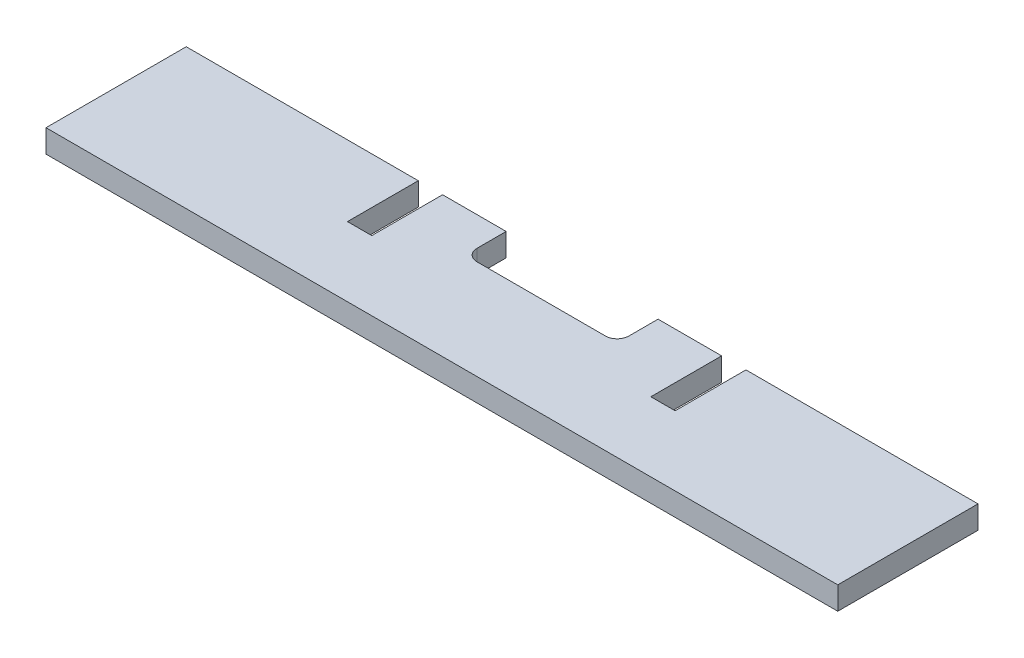
ISO-10303-21;
HEADER;
FILE_DESCRIPTION(('STEP AP214'),'2;1');
FILE_NAME('part.step','',(''),(''),'','','');
FILE_SCHEMA(('AUTOMOTIVE_DESIGN { 1 0 10303 214 1 1 1 1 }'));
ENDSEC;
DATA;
#1=APPLICATION_CONTEXT('core data for automotive mechanical design processes');
#2=APPLICATION_PROTOCOL_DEFINITION('international standard','automotive_design',2000,#1);
#3=PRODUCT_CONTEXT('',#1,'mechanical');
#4=PRODUCT('Part','Part','',(#3));
#5=PRODUCT_RELATED_PRODUCT_CATEGORY('part','',(#4));
#6=PRODUCT_DEFINITION_FORMATION('','',#4);
#7=PRODUCT_DEFINITION_CONTEXT('part definition',#1,'design');
#8=PRODUCT_DEFINITION('design','',#6,#7);
#9=PRODUCT_DEFINITION_SHAPE('','',#8);
#10=(LENGTH_UNIT() NAMED_UNIT(*) SI_UNIT(.MILLI.,.METRE.));
#11=(NAMED_UNIT(*) PLANE_ANGLE_UNIT() SI_UNIT($,.RADIAN.));
#12=(NAMED_UNIT(*) SI_UNIT($,.STERADIAN.) SOLID_ANGLE_UNIT());
#13=UNCERTAINTY_MEASURE_WITH_UNIT(LENGTH_MEASURE(1.E-05),#10,'distance_accuracy_value','');
#14=(GEOMETRIC_REPRESENTATION_CONTEXT(3) GLOBAL_UNCERTAINTY_ASSIGNED_CONTEXT((#13)) GLOBAL_UNIT_ASSIGNED_CONTEXT((#10,
#11,#12)) REPRESENTATION_CONTEXT('',''));
#15=CARTESIAN_POINT('',(0.,0.,0.));
#16=DIRECTION('',(0.,0.,1.));
#17=DIRECTION('',(1.,0.,0.));
#18=AXIS2_PLACEMENT_3D('',#15,#16,#17);
#19=CARTESIAN_POINT('',(4423.78804568099,847.725,0.));
#20=DIRECTION('',(0.,0.,1.));
#21=DIRECTION('',(1.,0.,0.));
#22=AXIS2_PLACEMENT_3D('',#19,#20,#21);
#23=PLANE('',#22);
#24=DIRECTION('',(0.,1.,0.));
#25=VECTOR('',#24,1.);
#26=CARTESIAN_POINT('',(-41.275,-2295.26058781173,0.));
#27=LINE('',#26,#25);
#28=CARTESIAN_POINT('',(-41.275,841.502,0.));
#29=VERTEX_POINT('',#28);
#30=CARTESIAN_POINT('',(-41.275,853.948,0.));
#31=VERTEX_POINT('',#30);
#32=EDGE_CURVE('E185',#29,#31,#27,.T.);
#33=ORIENTED_EDGE('',*,*,#32,.F.);
#34=DIRECTION('',(-1.,0.,0.));
#35=VECTOR('',#34,1.);
#36=CARTESIAN_POINT('',(4423.78804568099,841.502,0.));
#37=LINE('',#36,#35);
#38=CARTESIAN_POINT('',(-75.819,841.502,0.));
#39=VERTEX_POINT('',#38);
#40=EDGE_CURVE('E197',#29,#39,#37,.T.);
#41=ORIENTED_EDGE('',*,*,#40,.T.);
#42=DIRECTION('',(0.,-1.,0.));
#43=VECTOR('',#42,1.);
#44=CARTESIAN_POINT('',(-75.819,847.725,0.));
#45=LINE('',#44,#43);
#46=CARTESIAN_POINT('',(-75.819,853.948,0.));
#47=VERTEX_POINT('',#46);
#48=EDGE_CURVE('E341',#47,#39,#45,.T.);
#49=ORIENTED_EDGE('',*,*,#48,.F.);
#50=DIRECTION('',(-1.,0.,0.));
#51=VECTOR('',#50,1.);
#52=CARTESIAN_POINT('',(4423.78804568099,853.948,0.));
#53=LINE('',#52,#51);
#54=EDGE_CURVE('E199',#31,#47,#53,.T.);
#55=ORIENTED_EDGE('',*,*,#54,.F.);
#56=EDGE_LOOP('',(#33,#41,#49,#55));
#57=FACE_BOUND('',#56,.T.);
#58=ADVANCED_FACE('F14',(#57),#23,.F.);
#59=CARTESIAN_POINT('',(4423.78804568099,853.948,38.1));
#60=DIRECTION('',(0.,-1.,0.));
#61=DIRECTION('',(0.,0.,-1.));
#62=AXIS2_PLACEMENT_3D('',#59,#60,#61);
#63=PLANE('',#62);
#64=DIRECTION('',(0.,0.,-1.));
#65=VECTOR('',#64,1.);
#66=CARTESIAN_POINT('',(41.275,853.948,38.0999999999987));
#67=LINE('',#66,#65);
#68=CARTESIAN_POINT('',(41.275,853.948,15.875));
#69=VERTEX_POINT('',#68);
#70=CARTESIAN_POINT('',(41.275,853.948,0.));
#71=VERTEX_POINT('',#70);
#72=EDGE_CURVE('E311',#69,#71,#67,.T.);
#73=ORIENTED_EDGE('',*,*,#72,.F.);
#74=CARTESIAN_POINT('',(34.925,853.948,15.875));
#75=DIRECTION('',(0.,-1.,0.));
#76=DIRECTION('',(0.,0.,-1.));
#77=AXIS2_PLACEMENT_3D('',#74,#75,#76);
#78=CIRCLE('',#77,6.35);
#79=CARTESIAN_POINT('',(34.925,853.948,22.225));
#80=VERTEX_POINT('',#79);
#81=EDGE_CURVE('E23',#69,#80,#78,.T.);
#82=ORIENTED_EDGE('',*,*,#81,.T.);
#83=DIRECTION('',(-1.,0.,0.));
#84=VECTOR('',#83,1.);
#85=CARTESIAN_POINT('',(4423.78804568099,853.948,22.2250000000005));
#86=LINE('',#85,#84);
#87=CARTESIAN_POINT('',(-34.925,853.948,22.225));
#88=VERTEX_POINT('',#87);
#89=EDGE_CURVE('E309',#80,#88,#86,.T.);
#90=ORIENTED_EDGE('',*,*,#89,.T.);
#91=CARTESIAN_POINT('',(-34.925,853.948,15.875));
#92=DIRECTION('',(0.,-1.,0.));
#93=DIRECTION('',(0.,0.,-1.));
#94=AXIS2_PLACEMENT_3D('',#91,#92,#93);
#95=CIRCLE('',#94,6.35);
#96=CARTESIAN_POINT('',(-41.275,853.948,15.875));
#97=VERTEX_POINT('',#96);
#98=EDGE_CURVE('E298',#88,#97,#95,.T.);
#99=ORIENTED_EDGE('',*,*,#98,.T.);
#100=DIRECTION('',(0.,0.,-1.));
#101=VECTOR('',#100,1.);
#102=CARTESIAN_POINT('',(-41.275,853.948,38.0999999999987));
#103=LINE('',#102,#101);
#104=EDGE_CURVE('E317',#97,#31,#103,.T.);
#105=ORIENTED_EDGE('',*,*,#104,.T.);
#106=ORIENTED_EDGE('',*,*,#54,.T.);
#107=DIRECTION('',(0.,0.,-1.));
#108=VECTOR('',#107,1.);
#109=CARTESIAN_POINT('',(-75.819,853.948,38.1));
#110=LINE('',#109,#108);
#111=CARTESIAN_POINT('',(-75.819,853.948,38.481));
#112=VERTEX_POINT('',#111);
#113=EDGE_CURVE('E265',#112,#47,#110,.T.);
#114=ORIENTED_EDGE('',*,*,#113,.F.);
#115=DIRECTION('',(1.,0.,0.));
#116=VECTOR('',#115,1.);
#117=CARTESIAN_POINT('',(4423.78804568099,853.948,38.4810000000005));
#118=LINE('',#117,#116);
#119=CARTESIAN_POINT('',(-89.027,853.948,38.481));
#120=VERTEX_POINT('',#119);
#121=EDGE_CURVE('E262',#120,#112,#118,.T.);
#122=ORIENTED_EDGE('',*,*,#121,.F.);
#123=DIRECTION('',(0.,0.,1.));
#124=VECTOR('',#123,1.);
#125=CARTESIAN_POINT('',(-89.027,853.948,38.1));
#126=LINE('',#125,#124);
#127=CARTESIAN_POINT('',(-89.027,853.948,0.));
#128=VERTEX_POINT('',#127);
#129=EDGE_CURVE('E269',#128,#120,#126,.T.);
#130=ORIENTED_EDGE('',*,*,#129,.F.);
#131=CARTESIAN_POINT('',(-215.10625,853.948,0.));
#132=VERTEX_POINT('',#131);
#133=EDGE_CURVE('E346',#128,#132,#53,.T.);
#134=ORIENTED_EDGE('',*,*,#133,.T.);
#135=DIRECTION('',(0.,0.,1.));
#136=VECTOR('',#135,1.);
#137=CARTESIAN_POINT('',(-215.10625,853.948,38.1));
#138=LINE('',#137,#136);
#139=CARTESIAN_POINT('',(-215.10625,853.948,76.2));
#140=VERTEX_POINT('',#139);
#141=EDGE_CURVE('E231',#132,#140,#138,.T.);
#142=ORIENTED_EDGE('',*,*,#141,.T.);
#143=DIRECTION('',(-1.,0.,0.));
#144=VECTOR('',#143,1.);
#145=CARTESIAN_POINT('',(4423.78804568099,853.948,76.2));
#146=LINE('',#145,#144);
#147=CARTESIAN_POINT('',(215.10625,853.948,76.2));
#148=VERTEX_POINT('',#147);
#149=EDGE_CURVE('E338',#148,#140,#146,.T.);
#150=ORIENTED_EDGE('',*,*,#149,.F.);
#151=DIRECTION('',(0.,0.,-1.));
#152=VECTOR('',#151,1.);
#153=CARTESIAN_POINT('',(215.10625,853.948,38.1));
#154=LINE('',#153,#152);
#155=CARTESIAN_POINT('',(215.10625,853.948,0.));
#156=VERTEX_POINT('',#155);
#157=EDGE_CURVE('E251',#148,#156,#154,.T.);
#158=ORIENTED_EDGE('',*,*,#157,.T.);
#159=CARTESIAN_POINT('',(89.027,853.948,0.));
#160=VERTEX_POINT('',#159);
#161=EDGE_CURVE('E218',#156,#160,#53,.T.);
#162=ORIENTED_EDGE('',*,*,#161,.T.);
#163=DIRECTION('',(0.,0.,-1.));
#164=VECTOR('',#163,1.);
#165=CARTESIAN_POINT('',(89.027,853.948,38.1));
#166=LINE('',#165,#164);
#167=CARTESIAN_POINT('',(89.027,853.948,38.481));
#168=VERTEX_POINT('',#167);
#169=EDGE_CURVE('E279',#168,#160,#166,.T.);
#170=ORIENTED_EDGE('',*,*,#169,.F.);
#171=DIRECTION('',(1.,0.,0.));
#172=VECTOR('',#171,1.);
#173=CARTESIAN_POINT('',(4423.78804568099,853.948,38.4810000000005));
#174=LINE('',#173,#172);
#175=CARTESIAN_POINT('',(75.819,853.948,38.481));
#176=VERTEX_POINT('',#175);
#177=EDGE_CURVE('E276',#176,#168,#174,.T.);
#178=ORIENTED_EDGE('',*,*,#177,.F.);
#179=DIRECTION('',(0.,0.,1.));
#180=VECTOR('',#179,1.);
#181=CARTESIAN_POINT('',(75.819,853.948,38.1));
#182=LINE('',#181,#180);
#183=CARTESIAN_POINT('',(75.819,853.948,0.));
#184=VERTEX_POINT('',#183);
#185=EDGE_CURVE('E273',#184,#176,#182,.T.);
#186=ORIENTED_EDGE('',*,*,#185,.F.);
#187=EDGE_CURVE('E329',#184,#71,#53,.T.);
#188=ORIENTED_EDGE('',*,*,#187,.T.);
#189=EDGE_LOOP('',(#73,#82,#90,#99,#105,#106,#114,#122,#130,#134,#142,#150,#158,#162,#170,#178,
#186,#188));
#190=FACE_BOUND('',#189,.T.);
#191=ADVANCED_FACE('F308',(#190),#63,.F.);
#192=CARTESIAN_POINT('',(4423.78804568099,841.502,38.1));
#193=DIRECTION('',(0.,1.,0.));
#194=DIRECTION('',(0.,0.,1.));
#195=AXIS2_PLACEMENT_3D('',#192,#193,#194);
#196=PLANE('',#195);
#197=DIRECTION('',(0.,0.,1.));
#198=VECTOR('',#197,1.);
#199=CARTESIAN_POINT('',(41.275,841.502,38.0999999999987));
#200=LINE('',#199,#198);
#201=CARTESIAN_POINT('',(41.275,841.502,0.));
#202=VERTEX_POINT('',#201);
#203=CARTESIAN_POINT('',(41.275,841.502,15.875));
#204=VERTEX_POINT('',#203);
#205=EDGE_CURVE('E192',#202,#204,#200,.T.);
#206=ORIENTED_EDGE('',*,*,#205,.F.);
#207=CARTESIAN_POINT('',(75.819,841.502,0.));
#208=VERTEX_POINT('',#207);
#209=EDGE_CURVE('E209',#208,#202,#37,.T.);
#210=ORIENTED_EDGE('',*,*,#209,.F.);
#211=DIRECTION('',(0.,0.,1.));
#212=VECTOR('',#211,1.);
#213=CARTESIAN_POINT('',(75.819,841.502,38.1));
#214=LINE('',#213,#212);
#215=CARTESIAN_POINT('',(75.819,841.502,38.481));
#216=VERTEX_POINT('',#215);
#217=EDGE_CURVE('E391',#208,#216,#214,.T.);
#218=ORIENTED_EDGE('',*,*,#217,.T.);
#219=DIRECTION('',(1.,0.,0.));
#220=VECTOR('',#219,1.);
#221=CARTESIAN_POINT('',(0.,841.502,38.481));
#222=LINE('',#221,#220);
#223=CARTESIAN_POINT('',(89.027,841.502,38.481));
#224=VERTEX_POINT('',#223);
#225=EDGE_CURVE('E388',#216,#224,#222,.T.);
#226=ORIENTED_EDGE('',*,*,#225,.T.);
#227=DIRECTION('',(0.,0.,-1.));
#228=VECTOR('',#227,1.);
#229=CARTESIAN_POINT('',(89.027,841.502,38.1));
#230=LINE('',#229,#228);
#231=CARTESIAN_POINT('',(89.027,841.502,0.));
#232=VERTEX_POINT('',#231);
#233=EDGE_CURVE('E385',#224,#232,#230,.T.);
#234=ORIENTED_EDGE('',*,*,#233,.T.);
#235=CARTESIAN_POINT('',(215.10625,841.502,0.));
#236=VERTEX_POINT('',#235);
#237=EDGE_CURVE('E212',#236,#232,#37,.T.);
#238=ORIENTED_EDGE('',*,*,#237,.F.);
#239=DIRECTION('',(0.,0.,1.));
#240=VECTOR('',#239,1.);
#241=CARTESIAN_POINT('',(215.10625,841.502,38.1));
#242=LINE('',#241,#240);
#243=CARTESIAN_POINT('',(215.10625,841.502,76.2));
#244=VERTEX_POINT('',#243);
#245=EDGE_CURVE('E260',#236,#244,#242,.T.);
#246=ORIENTED_EDGE('',*,*,#245,.T.);
#247=DIRECTION('',(-1.,0.,0.));
#248=VECTOR('',#247,1.);
#249=CARTESIAN_POINT('',(4423.78804568099,841.502,76.2));
#250=LINE('',#249,#248);
#251=CARTESIAN_POINT('',(-215.10625,841.502,76.2));
#252=VERTEX_POINT('',#251);
#253=EDGE_CURVE('E223',#244,#252,#250,.T.);
#254=ORIENTED_EDGE('',*,*,#253,.T.);
#255=DIRECTION('',(0.,0.,-1.));
#256=VECTOR('',#255,1.);
#257=CARTESIAN_POINT('',(-215.10625,841.502,38.1));
#258=LINE('',#257,#256);
#259=CARTESIAN_POINT('',(-215.10625,841.502,0.));
#260=VERTEX_POINT('',#259);
#261=EDGE_CURVE('E245',#252,#260,#258,.T.);
#262=ORIENTED_EDGE('',*,*,#261,.T.);
#263=CARTESIAN_POINT('',(-89.027,841.502,0.));
#264=VERTEX_POINT('',#263);
#265=EDGE_CURVE('E210',#264,#260,#37,.T.);
#266=ORIENTED_EDGE('',*,*,#265,.F.);
#267=DIRECTION('',(0.,0.,1.));
#268=VECTOR('',#267,1.);
#269=CARTESIAN_POINT('',(-89.027,841.502,38.1));
#270=LINE('',#269,#268);
#271=CARTESIAN_POINT('',(-89.027,841.502,38.481));
#272=VERTEX_POINT('',#271);
#273=EDGE_CURVE('E403',#264,#272,#270,.T.);
#274=ORIENTED_EDGE('',*,*,#273,.T.);
#275=DIRECTION('',(1.,0.,0.));
#276=VECTOR('',#275,1.);
#277=CARTESIAN_POINT('',(0.,841.502,38.481));
#278=LINE('',#277,#276);
#279=CARTESIAN_POINT('',(-75.819,841.502,38.481));
#280=VERTEX_POINT('',#279);
#281=EDGE_CURVE('E409',#272,#280,#278,.T.);
#282=ORIENTED_EDGE('',*,*,#281,.T.);
#283=DIRECTION('',(0.,0.,-1.));
#284=VECTOR('',#283,1.);
#285=CARTESIAN_POINT('',(-75.819,841.502,38.1));
#286=LINE('',#285,#284);
#287=EDGE_CURVE('E207',#280,#39,#286,.T.);
#288=ORIENTED_EDGE('',*,*,#287,.T.);
#289=ORIENTED_EDGE('',*,*,#40,.F.);
#290=DIRECTION('',(0.,0.,1.));
#291=VECTOR('',#290,1.);
#292=CARTESIAN_POINT('',(-41.275,841.502,38.0999999999987));
#293=LINE('',#292,#291);
#294=CARTESIAN_POINT('',(-41.275,841.502,15.875));
#295=VERTEX_POINT('',#294);
#296=EDGE_CURVE('E181',#29,#295,#293,.T.);
#297=ORIENTED_EDGE('',*,*,#296,.T.);
#298=CARTESIAN_POINT('',(-34.925,841.502,15.875));
#299=DIRECTION('',(0.,1.,0.));
#300=DIRECTION('',(0.,0.,1.));
#301=AXIS2_PLACEMENT_3D('',#298,#299,#300);
#302=CIRCLE('',#301,6.35);
#303=CARTESIAN_POINT('',(-34.925,841.502,22.225));
#304=VERTEX_POINT('',#303);
#305=EDGE_CURVE('E301',#295,#304,#302,.T.);
#306=ORIENTED_EDGE('',*,*,#305,.T.);
#307=DIRECTION('',(1.,0.,0.));
#308=VECTOR('',#307,1.);
#309=CARTESIAN_POINT('',(4423.78804568099,841.502,22.2250000000005));
#310=LINE('',#309,#308);
#311=CARTESIAN_POINT('',(34.925,841.502,22.225));
#312=VERTEX_POINT('',#311);
#313=EDGE_CURVE('E193',#304,#312,#310,.T.);
#314=ORIENTED_EDGE('',*,*,#313,.T.);
#315=CARTESIAN_POINT('',(34.925,841.502,15.875));
#316=DIRECTION('',(0.,1.,0.));
#317=DIRECTION('',(0.,0.,1.));
#318=AXIS2_PLACEMENT_3D('',#315,#316,#317);
#319=CIRCLE('',#318,6.35);
#320=EDGE_CURVE('E9',#312,#204,#319,.T.);
#321=ORIENTED_EDGE('',*,*,#320,.T.);
#322=EDGE_LOOP('',(#206,#210,#218,#226,#234,#238,#246,#254,#262,#266,#274,#282,#288,#289,#297,
#306,#314,#321));
#323=FACE_BOUND('',#322,.T.);
#324=ADVANCED_FACE('F204',(#323),#196,.F.);
#325=DIRECTION('',(0.,-1.,0.));
#326=VECTOR('',#325,1.);
#327=CARTESIAN_POINT('',(89.027,847.725,0.));
#328=LINE('',#327,#326);
#329=EDGE_CURVE('E333',#160,#232,#328,.T.);
#330=ORIENTED_EDGE('',*,*,#329,.F.);
#331=ORIENTED_EDGE('',*,*,#161,.F.);
#332=DIRECTION('',(0.,-1.,0.));
#333=VECTOR('',#332,1.);
#334=CARTESIAN_POINT('',(215.10625,847.725,0.));
#335=LINE('',#334,#333);
#336=EDGE_CURVE('E254',#156,#236,#335,.T.);
#337=ORIENTED_EDGE('',*,*,#336,.T.);
#338=ORIENTED_EDGE('',*,*,#237,.T.);
#339=EDGE_LOOP('',(#330,#331,#337,#338));
#340=FACE_BOUND('',#339,.T.);
#341=ADVANCED_FACE('F379',(#340),#23,.F.);
#342=ORIENTED_EDGE('',*,*,#209,.T.);
#343=DIRECTION('',(0.,1.,0.));
#344=VECTOR('',#343,1.);
#345=CARTESIAN_POINT('',(41.275,-2295.26058781173,0.));
#346=LINE('',#345,#344);
#347=EDGE_CURVE('E201',#202,#71,#346,.T.);
#348=ORIENTED_EDGE('',*,*,#347,.T.);
#349=ORIENTED_EDGE('',*,*,#187,.F.);
#350=DIRECTION('',(0.,1.,0.));
#351=VECTOR('',#350,1.);
#352=CARTESIAN_POINT('',(75.819,847.725,0.));
#353=LINE('',#352,#351);
#354=EDGE_CURVE('E328',#208,#184,#353,.T.);
#355=ORIENTED_EDGE('',*,*,#354,.F.);
#356=EDGE_LOOP('',(#342,#348,#349,#355));
#357=FACE_BOUND('',#356,.T.);
#358=ADVANCED_FACE('F326',(#357),#23,.F.);
#359=DIRECTION('',(0.,1.,0.));
#360=VECTOR('',#359,1.);
#361=CARTESIAN_POINT('',(-89.027,847.725,0.));
#362=LINE('',#361,#360);
#363=EDGE_CURVE('E334',#264,#128,#362,.T.);
#364=ORIENTED_EDGE('',*,*,#363,.F.);
#365=ORIENTED_EDGE('',*,*,#265,.T.);
#366=DIRECTION('',(0.,1.,0.));
#367=VECTOR('',#366,1.);
#368=CARTESIAN_POINT('',(-215.10625,847.725,0.));
#369=LINE('',#368,#367);
#370=EDGE_CURVE('E240',#260,#132,#369,.T.);
#371=ORIENTED_EDGE('',*,*,#370,.T.);
#372=ORIENTED_EDGE('',*,*,#133,.F.);
#373=EDGE_LOOP('',(#364,#365,#371,#372));
#374=FACE_BOUND('',#373,.T.);
#375=ADVANCED_FACE('F366',(#374),#23,.F.);
#376=CARTESIAN_POINT('',(215.10625,946.15,76.2));
#377=DIRECTION('',(-1.,0.,0.));
#378=DIRECTION('',(0.,1.,0.));
#379=AXIS2_PLACEMENT_3D('',#376,#377,#378);
#380=PLANE('',#379);
#381=ORIENTED_EDGE('',*,*,#336,.F.);
#382=ORIENTED_EDGE('',*,*,#157,.F.);
#383=DIRECTION('',(0.,1.,0.));
#384=VECTOR('',#383,1.);
#385=CARTESIAN_POINT('',(215.10625,847.725,76.2));
#386=LINE('',#385,#384);
#387=EDGE_CURVE('E257',#244,#148,#386,.T.);
#388=ORIENTED_EDGE('',*,*,#387,.F.);
#389=ORIENTED_EDGE('',*,*,#245,.F.);
#390=EDGE_LOOP('',(#381,#382,#388,#389));
#391=FACE_BOUND('',#390,.T.);
#392=ADVANCED_FACE('F378',(#391),#380,.F.);
#393=CARTESIAN_POINT('',(-215.10625,946.15,76.2));
#394=DIRECTION('',(1.,0.,0.));
#395=DIRECTION('',(0.,1.,0.));
#396=AXIS2_PLACEMENT_3D('',#393,#394,#395);
#397=PLANE('',#396);
#398=ORIENTED_EDGE('',*,*,#141,.F.);
#399=ORIENTED_EDGE('',*,*,#370,.F.);
#400=ORIENTED_EDGE('',*,*,#261,.F.);
#401=DIRECTION('',(0.,-1.,0.));
#402=VECTOR('',#401,1.);
#403=CARTESIAN_POINT('',(-215.10625,847.725,76.2));
#404=LINE('',#403,#402);
#405=EDGE_CURVE('E248',#140,#252,#404,.T.);
#406=ORIENTED_EDGE('',*,*,#405,.F.);
#407=EDGE_LOOP('',(#398,#399,#400,#406));
#408=FACE_BOUND('',#407,.T.);
#409=ADVANCED_FACE('F371',(#408),#397,.F.);
#410=CARTESIAN_POINT('',(4423.78804568099,847.725,76.2));
#411=DIRECTION('',(0.,0.,-1.));
#412=DIRECTION('',(-1.,0.,0.));
#413=AXIS2_PLACEMENT_3D('',#410,#411,#412);
#414=PLANE('',#413);
#415=ORIENTED_EDGE('',*,*,#253,.F.);
#416=ORIENTED_EDGE('',*,*,#387,.T.);
#417=ORIENTED_EDGE('',*,*,#149,.T.);
#418=ORIENTED_EDGE('',*,*,#405,.T.);
#419=EDGE_LOOP('',(#415,#416,#417,#418));
#420=FACE_BOUND('',#419,.T.);
#421=ADVANCED_FACE('F373',(#420),#414,.F.);
#422=CARTESIAN_POINT('',(-89.027,4406.76258781172,38.1));
#423=DIRECTION('',(1.,0.,0.));
#424=DIRECTION('',(0.,0.,-1.));
#425=AXIS2_PLACEMENT_3D('',#422,#423,#424);
#426=PLANE('',#425);
#427=ORIENTED_EDGE('',*,*,#363,.T.);
#428=ORIENTED_EDGE('',*,*,#129,.T.);
#429=DIRECTION('',(0.,-1.,0.));
#430=VECTOR('',#429,1.);
#431=CARTESIAN_POINT('',(-89.027,4406.76258781172,38.481));
#432=LINE('',#431,#430);
#433=EDGE_CURVE('E412',#120,#272,#432,.T.);
#434=ORIENTED_EDGE('',*,*,#433,.T.);
#435=ORIENTED_EDGE('',*,*,#273,.F.);
#436=EDGE_LOOP('',(#427,#428,#434,#435));
#437=FACE_BOUND('',#436,.T.);
#438=ADVANCED_FACE('F426',(#437),#426,.T.);
#439=CARTESIAN_POINT('',(-75.819,4406.76258781172,38.1));
#440=DIRECTION('',(-1.,0.,0.));
#441=DIRECTION('',(0.,0.,1.));
#442=AXIS2_PLACEMENT_3D('',#439,#440,#441);
#443=PLANE('',#442);
#444=ORIENTED_EDGE('',*,*,#48,.T.);
#445=ORIENTED_EDGE('',*,*,#287,.F.);
#446=DIRECTION('',(0.,-1.,0.));
#447=VECTOR('',#446,1.);
#448=CARTESIAN_POINT('',(-75.819,4406.76258781172,38.481));
#449=LINE('',#448,#447);
#450=EDGE_CURVE('E415',#112,#280,#449,.T.);
#451=ORIENTED_EDGE('',*,*,#450,.F.);
#452=ORIENTED_EDGE('',*,*,#113,.T.);
#453=EDGE_LOOP('',(#444,#445,#451,#452));
#454=FACE_BOUND('',#453,.T.);
#455=ADVANCED_FACE('F420',(#454),#443,.T.);
#456=CARTESIAN_POINT('',(0.,4406.76258781172,38.481));
#457=DIRECTION('',(0.,0.,-1.));
#458=DIRECTION('',(-1.,0.,0.));
#459=AXIS2_PLACEMENT_3D('',#456,#457,#458);
#460=PLANE('',#459);
#461=ORIENTED_EDGE('',*,*,#121,.T.);
#462=ORIENTED_EDGE('',*,*,#450,.T.);
#463=ORIENTED_EDGE('',*,*,#281,.F.);
#464=ORIENTED_EDGE('',*,*,#433,.F.);
#465=EDGE_LOOP('',(#461,#462,#463,#464));
#466=FACE_BOUND('',#465,.T.);
#467=ADVANCED_FACE('F423',(#466),#460,.T.);
#468=CARTESIAN_POINT('',(89.027,4406.76258781172,38.1));
#469=DIRECTION('',(-1.,0.,0.));
#470=DIRECTION('',(0.,0.,1.));
#471=AXIS2_PLACEMENT_3D('',#468,#469,#470);
#472=PLANE('',#471);
#473=ORIENTED_EDGE('',*,*,#329,.T.);
#474=ORIENTED_EDGE('',*,*,#233,.F.);
#475=DIRECTION('',(0.,-1.,0.));
#476=VECTOR('',#475,1.);
#477=CARTESIAN_POINT('',(89.027,4406.76258781172,38.481));
#478=LINE('',#477,#476);
#479=EDGE_CURVE('E396',#168,#224,#478,.T.);
#480=ORIENTED_EDGE('',*,*,#479,.F.);
#481=ORIENTED_EDGE('',*,*,#169,.T.);
#482=EDGE_LOOP('',(#473,#474,#480,#481));
#483=FACE_BOUND('',#482,.T.);
#484=ADVANCED_FACE('F383',(#483),#472,.T.);
#485=CARTESIAN_POINT('',(0.,4406.76258781172,38.481));
#486=DIRECTION('',(0.,0.,-1.));
#487=DIRECTION('',(-1.,0.,0.));
#488=AXIS2_PLACEMENT_3D('',#485,#486,#487);
#489=PLANE('',#488);
#490=ORIENTED_EDGE('',*,*,#177,.T.);
#491=ORIENTED_EDGE('',*,*,#479,.T.);
#492=ORIENTED_EDGE('',*,*,#225,.F.);
#493=DIRECTION('',(0.,-1.,0.));
#494=VECTOR('',#493,1.);
#495=CARTESIAN_POINT('',(75.819,4406.76258781172,38.481));
#496=LINE('',#495,#494);
#497=EDGE_CURVE('E390',#176,#216,#496,.T.);
#498=ORIENTED_EDGE('',*,*,#497,.F.);
#499=EDGE_LOOP('',(#490,#491,#492,#498));
#500=FACE_BOUND('',#499,.T.);
#501=ADVANCED_FACE('F596',(#500),#489,.T.);
#502=CARTESIAN_POINT('',(75.819,4406.76258781172,38.1));
#503=DIRECTION('',(1.,0.,0.));
#504=DIRECTION('',(0.,0.,-1.));
#505=AXIS2_PLACEMENT_3D('',#502,#503,#504);
#506=PLANE('',#505);
#507=ORIENTED_EDGE('',*,*,#354,.T.);
#508=ORIENTED_EDGE('',*,*,#185,.T.);
#509=ORIENTED_EDGE('',*,*,#497,.T.);
#510=ORIENTED_EDGE('',*,*,#217,.F.);
#511=EDGE_LOOP('',(#507,#508,#509,#510));
#512=FACE_BOUND('',#511,.T.);
#513=ADVANCED_FACE('F607',(#512),#506,.T.);
#514=CARTESIAN_POINT('',(41.275,-2295.26058781173,-5.53358328761521));
#515=DIRECTION('',(-1.,0.,0.));
#516=DIRECTION('',(0.,0.,1.));
#517=AXIS2_PLACEMENT_3D('',#514,#515,#516);
#518=PLANE('',#517);
#519=ORIENTED_EDGE('',*,*,#205,.T.);
#520=DIRECTION('',(0.,1.,0.));
#521=VECTOR('',#520,1.);
#522=CARTESIAN_POINT('',(41.275,-2295.26058781173,15.875));
#523=LINE('',#522,#521);
#524=EDGE_CURVE('E295',#204,#69,#523,.T.);
#525=ORIENTED_EDGE('',*,*,#524,.T.);
#526=ORIENTED_EDGE('',*,*,#72,.T.);
#527=ORIENTED_EDGE('',*,*,#347,.F.);
#528=EDGE_LOOP('',(#519,#525,#526,#527));
#529=FACE_BOUND('',#528,.T.);
#530=ADVANCED_FACE('F320',(#529),#518,.T.);
#531=CARTESIAN_POINT('',(-41.275,-2295.26058781173,-5.53358328761524));
#532=DIRECTION('',(-1.,0.,0.));
#533=DIRECTION('',(0.,0.,1.));
#534=AXIS2_PLACEMENT_3D('',#531,#532,#533);
#535=PLANE('',#534);
#536=ORIENTED_EDGE('',*,*,#104,.F.);
#537=DIRECTION('',(0.,1.,0.));
#538=VECTOR('',#537,1.);
#539=CARTESIAN_POINT('',(-41.275,841.502,15.875));
#540=LINE('',#539,#538);
#541=EDGE_CURVE('E188',#97,#295,#540,.F.);
#542=ORIENTED_EDGE('',*,*,#541,.T.);
#543=ORIENTED_EDGE('',*,*,#296,.F.);
#544=ORIENTED_EDGE('',*,*,#32,.T.);
#545=EDGE_LOOP('',(#536,#542,#543,#544));
#546=FACE_BOUND('',#545,.T.);
#547=ADVANCED_FACE('F184',(#546),#535,.F.);
#548=CARTESIAN_POINT('',(19.9758464336395,-2295.26058781173,22.225));
#549=DIRECTION('',(0.,0.,1.));
#550=DIRECTION('',(1.,0.,0.));
#551=AXIS2_PLACEMENT_3D('',#548,#549,#550);
#552=PLANE('',#551);
#553=ORIENTED_EDGE('',*,*,#313,.F.);
#554=DIRECTION('',(0.,1.,0.));
#555=VECTOR('',#554,1.);
#556=CARTESIAN_POINT('',(-34.925,853.948,22.225));
#557=LINE('',#556,#555);
#558=EDGE_CURVE('E289',#304,#88,#557,.T.);
#559=ORIENTED_EDGE('',*,*,#558,.T.);
#560=ORIENTED_EDGE('',*,*,#89,.F.);
#561=DIRECTION('',(0.,1.,0.));
#562=VECTOR('',#561,1.);
#563=CARTESIAN_POINT('',(34.925,-2295.26058781173,22.225));
#564=LINE('',#563,#562);
#565=EDGE_CURVE('E286',#80,#312,#564,.F.);
#566=ORIENTED_EDGE('',*,*,#565,.T.);
#567=EDGE_LOOP('',(#553,#559,#560,#566));
#568=FACE_BOUND('',#567,.T.);
#569=ADVANCED_FACE('F314',(#568),#552,.F.);
#570=CARTESIAN_POINT('',(-34.925,-2295.26058781173,15.875));
#571=DIRECTION('',(0.,-1.,0.));
#572=DIRECTION('',(0.,0.,-1.));
#573=AXIS2_PLACEMENT_3D('',#570,#571,#572);
#574=CYLINDRICAL_SURFACE('',#573,6.35);
#575=ORIENTED_EDGE('',*,*,#305,.F.);
#576=ORIENTED_EDGE('',*,*,#541,.F.);
#577=ORIENTED_EDGE('',*,*,#98,.F.);
#578=ORIENTED_EDGE('',*,*,#558,.F.);
#579=EDGE_LOOP('',(#575,#576,#577,#578));
#580=FACE_BOUND('',#579,.T.);
#581=ADVANCED_FACE('F457',(#580),#574,.F.);
#582=CARTESIAN_POINT('',(34.925,-2295.26058781173,15.875));
#583=DIRECTION('',(0.,1.,0.));
#584=DIRECTION('',(0.,0.,1.));
#585=AXIS2_PLACEMENT_3D('',#582,#583,#584);
#586=CYLINDRICAL_SURFACE('',#585,6.35);
#587=ORIENTED_EDGE('',*,*,#320,.F.);
#588=ORIENTED_EDGE('',*,*,#565,.F.);
#589=ORIENTED_EDGE('',*,*,#81,.F.);
#590=ORIENTED_EDGE('',*,*,#524,.F.);
#591=EDGE_LOOP('',(#587,#588,#589,#590));
#592=FACE_BOUND('',#591,.T.);
#593=ADVANCED_FACE('F16',(#592),#586,.F.);
#594=CLOSED_SHELL('',(#58,#191,#324,#341,#358,#375,#392,#409,#421,#438,#455,#467,#484,#501,#513,
#530,#547,#569,#581,#593));
#595=MANIFOLD_SOLID_BREP('B1',#594);
#596=ADVANCED_BREP_SHAPE_REPRESENTATION('',(#18,#595),#14);
#597=SHAPE_DEFINITION_REPRESENTATION(#9,#596);
ENDSEC;
END-ISO-10303-21;
